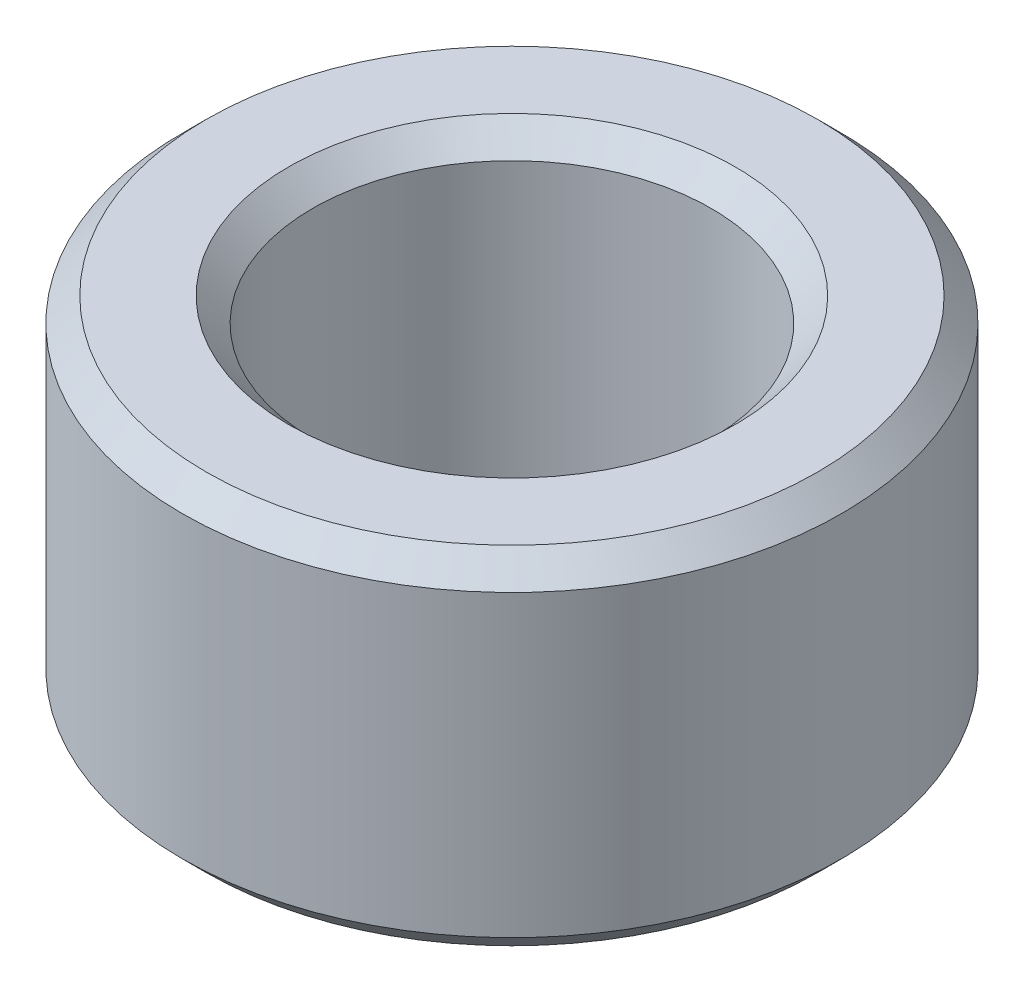
ISO-10303-21;
HEADER;
FILE_DESCRIPTION(('STEP AP214'),'2;1');
FILE_NAME('part.step','',(''),(''),'','','');
FILE_SCHEMA(('AUTOMOTIVE_DESIGN { 1 0 10303 214 1 1 1 1 }'));
ENDSEC;
DATA;
#1=APPLICATION_CONTEXT('core data for automotive mechanical design processes');
#2=APPLICATION_PROTOCOL_DEFINITION('international standard','automotive_design',2000,#1);
#3=PRODUCT_CONTEXT('',#1,'mechanical');
#4=PRODUCT('Part','Part','',(#3));
#5=PRODUCT_RELATED_PRODUCT_CATEGORY('part','',(#4));
#6=PRODUCT_DEFINITION_FORMATION('','',#4);
#7=PRODUCT_DEFINITION_CONTEXT('part definition',#1,'design');
#8=PRODUCT_DEFINITION('design','',#6,#7);
#9=PRODUCT_DEFINITION_SHAPE('','',#8);
#10=(LENGTH_UNIT() NAMED_UNIT(*) SI_UNIT(.MILLI.,.METRE.));
#11=(NAMED_UNIT(*) PLANE_ANGLE_UNIT() SI_UNIT($,.RADIAN.));
#12=(NAMED_UNIT(*) SI_UNIT($,.STERADIAN.) SOLID_ANGLE_UNIT());
#13=UNCERTAINTY_MEASURE_WITH_UNIT(LENGTH_MEASURE(1.E-05),#10,'distance_accuracy_value','');
#14=(GEOMETRIC_REPRESENTATION_CONTEXT(3) GLOBAL_UNCERTAINTY_ASSIGNED_CONTEXT((#13)) GLOBAL_UNIT_ASSIGNED_CONTEXT((#10,
#11,#12)) REPRESENTATION_CONTEXT('',''));
#15=CARTESIAN_POINT('',(0.,0.,0.));
#16=DIRECTION('',(0.,0.,1.));
#17=DIRECTION('',(1.,0.,0.));
#18=AXIS2_PLACEMENT_3D('',#15,#16,#17);
#19=CARTESIAN_POINT('',(0.,52.6281612246345,0.));
#20=DIRECTION('',(0.,-1.,0.));
#21=DIRECTION('',(0.,0.,-1.));
#22=AXIS2_PLACEMENT_3D('',#19,#20,#21);
#23=CYLINDRICAL_SURFACE('',#22,50.);
#24=CARTESIAN_POINT('',(0.,3.63826083871729,0.));
#25=DIRECTION('',(0.,1.,0.));
#26=DIRECTION('',(0.,0.,1.));
#27=AXIS2_PLACEMENT_3D('',#24,#25,#26);
#28=CIRCLE('',#27,50.);
#29=CARTESIAN_POINT('',(0.,3.63826083871729,50.));
#30=VERTEX_POINT('',#29);
#31=EDGE_CURVE('E10',#30,#30,#28,.T.);
#32=ORIENTED_EDGE('',*,*,#31,.T.);
#33=EDGE_LOOP('',(#32));
#34=FACE_BOUND('',#33,.T.);
#35=CARTESIAN_POINT('',(0.,48.9899003859171,0.));
#36=DIRECTION('',(0.,1.,0.));
#37=DIRECTION('',(0.,0.,1.));
#38=AXIS2_PLACEMENT_3D('',#35,#36,#37);
#39=CIRCLE('',#38,50.);
#40=CARTESIAN_POINT('',(0.,48.9899003859171,50.));
#41=VERTEX_POINT('',#40);
#42=EDGE_CURVE('E50',#41,#41,#39,.F.);
#43=ORIENTED_EDGE('',*,*,#42,.T.);
#44=EDGE_LOOP('',(#43));
#45=FACE_BOUND('',#44,.T.);
#46=ADVANCED_FACE('F39',(#34,#45),#23,.T.);
#47=CARTESIAN_POINT('',(0.,52.6281612246345,0.));
#48=DIRECTION('',(0.,1.,0.));
#49=DIRECTION('',(0.,0.,1.));
#50=AXIS2_PLACEMENT_3D('',#47,#48,#49);
#51=PLANE('',#50);
#52=CARTESIAN_POINT('',(0.,52.6281612246345,0.));
#53=DIRECTION('',(0.,1.,0.));
#54=DIRECTION('',(0.,0.,1.));
#55=AXIS2_PLACEMENT_3D('',#52,#53,#54);
#56=CIRCLE('',#55,33.8766300800308);
#57=CARTESIAN_POINT('',(0.,52.6281612246345,33.8766300800308));
#58=VERTEX_POINT('',#57);
#59=EDGE_CURVE('E58',#58,#58,#56,.F.);
#60=ORIENTED_EDGE('',*,*,#59,.T.);
#61=EDGE_LOOP('',(#60));
#62=FACE_BOUND('',#61,.T.);
#63=CARTESIAN_POINT('',(0.,52.6281612246345,0.));
#64=DIRECTION('',(0.,1.,0.));
#65=DIRECTION('',(0.,0.,1.));
#66=AXIS2_PLACEMENT_3D('',#63,#64,#65);
#67=CIRCLE('',#66,46.3617391612827);
#68=CARTESIAN_POINT('',(0.,52.6281612246345,46.3617391612827));
#69=VERTEX_POINT('',#68);
#70=EDGE_CURVE('E61',#69,#69,#67,.T.);
#71=ORIENTED_EDGE('',*,*,#70,.T.);
#72=EDGE_LOOP('',(#71));
#73=FACE_BOUND('',#72,.T.);
#74=ADVANCED_FACE('F88',(#62,#73),#51,.T.);
#75=CARTESIAN_POINT('',(0.,0.,0.));
#76=DIRECTION('',(0.,1.,0.));
#77=DIRECTION('',(0.,0.,1.));
#78=AXIS2_PLACEMENT_3D('',#75,#76,#77);
#79=PLANE('',#78);
#80=CARTESIAN_POINT('',(0.,0.,0.));
#81=DIRECTION('',(0.,1.,0.));
#82=DIRECTION('',(0.,0.,1.));
#83=AXIS2_PLACEMENT_3D('',#80,#81,#82);
#84=CIRCLE('',#83,33.8766300800308);
#85=CARTESIAN_POINT('',(0.,0.,33.8766300800308));
#86=VERTEX_POINT('',#85);
#87=EDGE_CURVE('E51',#86,#86,#84,.T.);
#88=ORIENTED_EDGE('',*,*,#87,.T.);
#89=EDGE_LOOP('',(#88));
#90=FACE_BOUND('',#89,.T.);
#91=CARTESIAN_POINT('',(0.,0.,0.));
#92=DIRECTION('',(0.,1.,0.));
#93=DIRECTION('',(0.,0.,1.));
#94=AXIS2_PLACEMENT_3D('',#91,#92,#93);
#95=CIRCLE('',#94,46.3617391612827);
#96=CARTESIAN_POINT('',(0.,0.,46.3617391612827));
#97=VERTEX_POINT('',#96);
#98=EDGE_CURVE('E54',#97,#97,#95,.F.);
#99=ORIENTED_EDGE('',*,*,#98,.T.);
#100=EDGE_LOOP('',(#99));
#101=FACE_BOUND('',#100,.T.);
#102=ADVANCED_FACE('F83',(#90,#101),#79,.F.);
#103=CARTESIAN_POINT('',(0.,52.6281612246345,0.));
#104=DIRECTION('',(0.,-1.,0.));
#105=DIRECTION('',(0.,0.,-1.));
#106=AXIS2_PLACEMENT_3D('',#103,#104,#105);
#107=CYLINDRICAL_SURFACE('',#106,30.2383692413135);
#108=CARTESIAN_POINT('',(0.,48.9899003859171,0.));
#109=DIRECTION('',(0.,1.,0.));
#110=DIRECTION('',(0.,0.,1.));
#111=AXIS2_PLACEMENT_3D('',#108,#109,#110);
#112=CIRCLE('',#111,30.2383692413135);
#113=CARTESIAN_POINT('',(0.,48.9899003859171,30.2383692413135));
#114=VERTEX_POINT('',#113);
#115=EDGE_CURVE('E67',#114,#114,#112,.T.);
#116=ORIENTED_EDGE('',*,*,#115,.T.);
#117=EDGE_LOOP('',(#116));
#118=FACE_BOUND('',#117,.T.);
#119=CARTESIAN_POINT('',(0.,3.63826083871731,0.));
#120=DIRECTION('',(0.,1.,0.));
#121=DIRECTION('',(0.,0.,1.));
#122=AXIS2_PLACEMENT_3D('',#119,#120,#121);
#123=CIRCLE('',#122,30.2383692413135);
#124=CARTESIAN_POINT('',(0.,3.63826083871731,30.2383692413135));
#125=VERTEX_POINT('',#124);
#126=EDGE_CURVE('E69',#125,#125,#123,.F.);
#127=ORIENTED_EDGE('',*,*,#126,.T.);
#128=EDGE_LOOP('',(#127));
#129=FACE_BOUND('',#128,.T.);
#130=ADVANCED_FACE('F71',(#118,#129),#107,.F.);
#131=CARTESIAN_POINT('',(0.,48.9899003859171,0.));
#132=DIRECTION('',(0.,1.,0.));
#133=DIRECTION('',(0.,0.,1.));
#134=AXIS2_PLACEMENT_3D('',#131,#132,#133);
#135=CONICAL_SURFACE('',#134,30.2383692413135,0.785398163397451);
#136=ORIENTED_EDGE('',*,*,#59,.F.);
#137=EDGE_LOOP('',(#136));
#138=FACE_BOUND('',#137,.T.);
#139=ORIENTED_EDGE('',*,*,#115,.F.);
#140=EDGE_LOOP('',(#139));
#141=FACE_BOUND('',#140,.T.);
#142=ADVANCED_FACE('F77',(#138,#141),#135,.F.);
#143=CARTESIAN_POINT('',(0.,0.,0.));
#144=DIRECTION('',(0.,-1.,0.));
#145=DIRECTION('',(0.,0.,-1.));
#146=AXIS2_PLACEMENT_3D('',#143,#144,#145);
#147=CONICAL_SURFACE('',#146,33.8766300800308,0.785398163397446);
#148=ORIENTED_EDGE('',*,*,#126,.F.);
#149=EDGE_LOOP('',(#148));
#150=FACE_BOUND('',#149,.T.);
#151=ORIENTED_EDGE('',*,*,#87,.F.);
#152=EDGE_LOOP('',(#151));
#153=FACE_BOUND('',#152,.T.);
#154=ADVANCED_FACE('F73',(#150,#153),#147,.F.);
#155=CARTESIAN_POINT('',(0.,3.63826083871729,0.));
#156=DIRECTION('',(0.,1.,0.));
#157=DIRECTION('',(0.,0.,1.));
#158=AXIS2_PLACEMENT_3D('',#155,#156,#157);
#159=CONICAL_SURFACE('',#158,50.,0.785398163397451);
#160=ORIENTED_EDGE('',*,*,#98,.F.);
#161=EDGE_LOOP('',(#160));
#162=FACE_BOUND('',#161,.T.);
#163=ORIENTED_EDGE('',*,*,#31,.F.);
#164=EDGE_LOOP('',(#163));
#165=FACE_BOUND('',#164,.T.);
#166=ADVANCED_FACE('F76',(#162,#165),#159,.T.);
#167=CARTESIAN_POINT('',(0.,52.6281612246345,0.));
#168=DIRECTION('',(0.,-1.,0.));
#169=DIRECTION('',(0.,0.,-1.));
#170=AXIS2_PLACEMENT_3D('',#167,#168,#169);
#171=CONICAL_SURFACE('',#170,46.3617391612827,0.785398163397446);
#172=ORIENTED_EDGE('',*,*,#42,.F.);
#173=EDGE_LOOP('',(#172));
#174=FACE_BOUND('',#173,.T.);
#175=ORIENTED_EDGE('',*,*,#70,.F.);
#176=EDGE_LOOP('',(#175));
#177=FACE_BOUND('',#176,.T.);
#178=ADVANCED_FACE('F45',(#174,#177),#171,.T.);
#179=CLOSED_SHELL('',(#46,#74,#102,#130,#142,#154,#166,#178));
#180=MANIFOLD_SOLID_BREP('B2',#179);
#181=ADVANCED_BREP_SHAPE_REPRESENTATION('',(#18,#180),#14);
#182=SHAPE_DEFINITION_REPRESENTATION(#9,#181);
ENDSEC;
END-ISO-10303-21;
